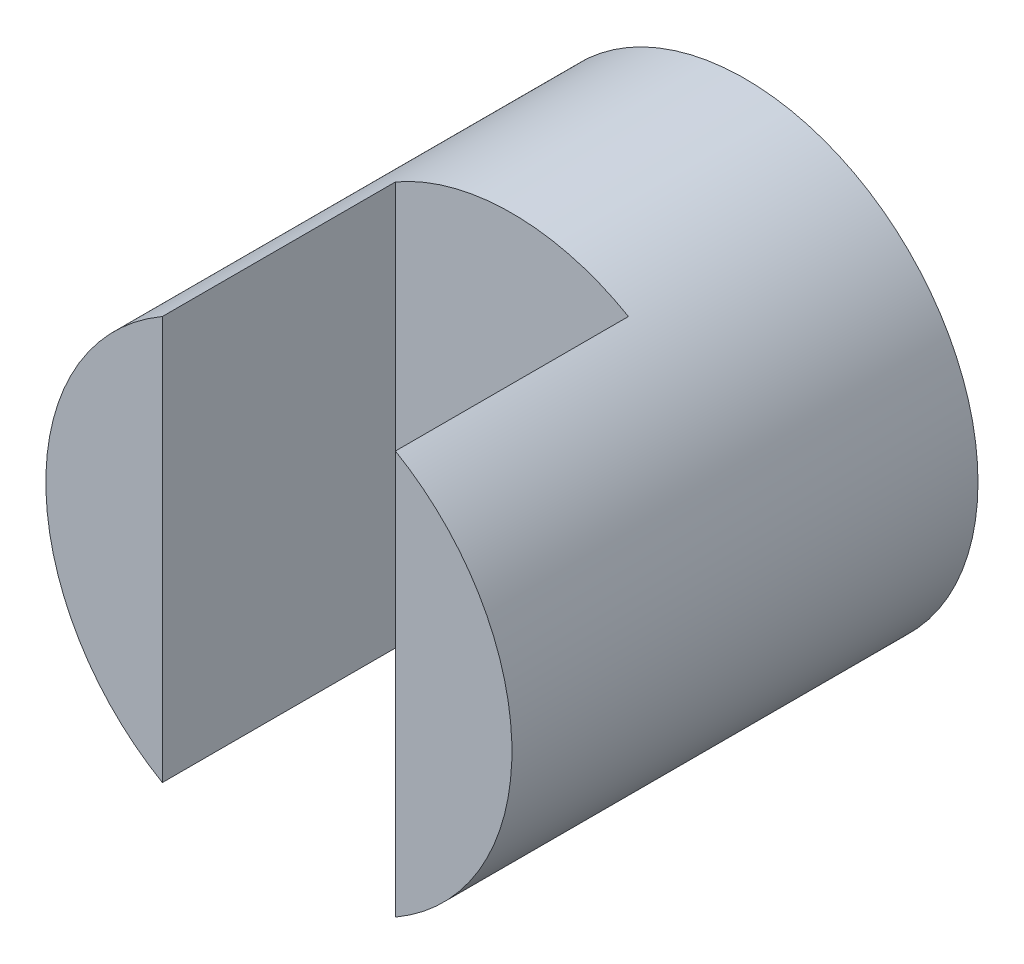
ISO-10303-21;
HEADER;
FILE_DESCRIPTION(('STEP AP214'),'2;1');
FILE_NAME('part.step','',(''),(''),'','','');
FILE_SCHEMA(('AUTOMOTIVE_DESIGN { 1 0 10303 214 1 1 1 1 }'));
ENDSEC;
DATA;
#1=APPLICATION_CONTEXT('core data for automotive mechanical design processes');
#2=APPLICATION_PROTOCOL_DEFINITION('international standard','automotive_design',2000,#1);
#3=PRODUCT_CONTEXT('',#1,'mechanical');
#4=PRODUCT('Part','Part','',(#3));
#5=PRODUCT_RELATED_PRODUCT_CATEGORY('part','',(#4));
#6=PRODUCT_DEFINITION_FORMATION('','',#4);
#7=PRODUCT_DEFINITION_CONTEXT('part definition',#1,'design');
#8=PRODUCT_DEFINITION('design','',#6,#7);
#9=PRODUCT_DEFINITION_SHAPE('','',#8);
#10=(LENGTH_UNIT() NAMED_UNIT(*) SI_UNIT(.MILLI.,.METRE.));
#11=(NAMED_UNIT(*) PLANE_ANGLE_UNIT() SI_UNIT($,.RADIAN.));
#12=(NAMED_UNIT(*) SI_UNIT($,.STERADIAN.) SOLID_ANGLE_UNIT());
#13=UNCERTAINTY_MEASURE_WITH_UNIT(LENGTH_MEASURE(1.E-05),#10,'distance_accuracy_value','');
#14=(GEOMETRIC_REPRESENTATION_CONTEXT(3) GLOBAL_UNCERTAINTY_ASSIGNED_CONTEXT((#13)) GLOBAL_UNIT_ASSIGNED_CONTEXT((#10,
#11,#12)) REPRESENTATION_CONTEXT('',''));
#15=CARTESIAN_POINT('',(0.,0.,0.));
#16=DIRECTION('',(0.,0.,1.));
#17=DIRECTION('',(1.,0.,0.));
#18=AXIS2_PLACEMENT_3D('',#15,#16,#17);
#19=CARTESIAN_POINT('',(0.,0.,4.));
#20=DIRECTION('',(0.,0.,1.));
#21=DIRECTION('',(1.,0.,0.));
#22=AXIS2_PLACEMENT_3D('',#19,#20,#21);
#23=PLANE('',#22);
#24=DIRECTION('',(0.,1.,0.));
#25=VECTOR('',#24,1.);
#26=CARTESIAN_POINT('',(1.,0.,4.));
#27=LINE('',#26,#25);
#28=CARTESIAN_POINT('',(1.,-1.73205080756888,4.));
#29=VERTEX_POINT('',#28);
#30=CARTESIAN_POINT('',(1.,1.73205080756888,4.));
#31=VERTEX_POINT('',#30);
#32=EDGE_CURVE('E56',#29,#31,#27,.T.);
#33=ORIENTED_EDGE('',*,*,#32,.F.);
#34=CARTESIAN_POINT('',(0.,0.,4.));
#35=DIRECTION('',(0.,0.,1.));
#36=DIRECTION('',(1.,0.,0.));
#37=AXIS2_PLACEMENT_3D('',#34,#35,#36);
#38=CIRCLE('',#37,2.);
#39=EDGE_CURVE('E94',#29,#31,#38,.T.);
#40=ORIENTED_EDGE('',*,*,#39,.T.);
#41=EDGE_LOOP('',(#33,#40));
#42=FACE_BOUND('',#41,.T.);
#43=ADVANCED_FACE('F33',(#42),#23,.T.);
#44=CARTESIAN_POINT('',(0.,0.,4.));
#45=DIRECTION('',(0.,0.,-1.));
#46=DIRECTION('',(-1.,0.,0.));
#47=AXIS2_PLACEMENT_3D('',#44,#45,#46);
#48=CYLINDRICAL_SURFACE('',#47,2.);
#49=CARTESIAN_POINT('',(-1.,1.73205080756888,4.));
#50=VERTEX_POINT('',#49);
#51=CARTESIAN_POINT('',(-1.,-1.73205080756888,4.));
#52=VERTEX_POINT('',#51);
#53=EDGE_CURVE('E103',#50,#52,#38,.T.);
#54=ORIENTED_EDGE('',*,*,#53,.F.);
#55=DIRECTION('',(0.,0.,-1.));
#56=VECTOR('',#55,1.);
#57=CARTESIAN_POINT('',(-1.,1.73205080756888,4.));
#58=LINE('',#57,#56);
#59=CARTESIAN_POINT('',(-1.,1.73205080756888,2.));
#60=VERTEX_POINT('',#59);
#61=EDGE_CURVE('E48',#50,#60,#58,.T.);
#62=ORIENTED_EDGE('',*,*,#61,.T.);
#63=CARTESIAN_POINT('',(0.,0.,2.));
#64=DIRECTION('',(0.,0.,-1.));
#65=DIRECTION('',(-1.,0.,0.));
#66=AXIS2_PLACEMENT_3D('',#63,#64,#65);
#67=CIRCLE('',#66,2.);
#68=CARTESIAN_POINT('',(1.,1.73205080756888,2.));
#69=VERTEX_POINT('',#68);
#70=EDGE_CURVE('E37',#60,#69,#67,.T.);
#71=ORIENTED_EDGE('',*,*,#70,.T.);
#72=DIRECTION('',(0.,0.,-1.));
#73=VECTOR('',#72,1.);
#74=CARTESIAN_POINT('',(1.,1.73205080756888,4.));
#75=LINE('',#74,#73);
#76=EDGE_CURVE('E96',#69,#31,#75,.F.);
#77=ORIENTED_EDGE('',*,*,#76,.T.);
#78=ORIENTED_EDGE('',*,*,#39,.F.);
#79=DIRECTION('',(0.,0.,-1.));
#80=VECTOR('',#79,1.);
#81=CARTESIAN_POINT('',(1.,-1.73205080756888,4.));
#82=LINE('',#81,#80);
#83=CARTESIAN_POINT('',(1.,-1.73205080756888,2.));
#84=VERTEX_POINT('',#83);
#85=EDGE_CURVE('E92',#29,#84,#82,.T.);
#86=ORIENTED_EDGE('',*,*,#85,.T.);
#87=CARTESIAN_POINT('',(-1.,-1.73205080756888,2.));
#88=VERTEX_POINT('',#87);
#89=EDGE_CURVE('E11',#84,#88,#67,.T.);
#90=ORIENTED_EDGE('',*,*,#89,.T.);
#91=DIRECTION('',(0.,0.,-1.));
#92=VECTOR('',#91,1.);
#93=CARTESIAN_POINT('',(-1.,-1.73205080756888,4.));
#94=LINE('',#93,#92);
#95=EDGE_CURVE('E73',#88,#52,#94,.F.);
#96=ORIENTED_EDGE('',*,*,#95,.T.);
#97=EDGE_LOOP('',(#54,#62,#71,#77,#78,#86,#90,#96));
#98=FACE_BOUND('',#97,.T.);
#99=CARTESIAN_POINT('',(0.,0.,0.));
#100=DIRECTION('',(0.,0.,1.));
#101=DIRECTION('',(1.,0.,0.));
#102=AXIS2_PLACEMENT_3D('',#99,#100,#101);
#103=CIRCLE('',#102,2.);
#104=CARTESIAN_POINT('',(2.,0.,0.));
#105=VERTEX_POINT('',#104);
#106=EDGE_CURVE('E95',#105,#105,#103,.T.);
#107=ORIENTED_EDGE('',*,*,#106,.T.);
#108=EDGE_LOOP('',(#107));
#109=FACE_BOUND('',#108,.T.);
#110=ADVANCED_FACE('F35',(#98,#109),#48,.T.);
#111=DIRECTION('',(0.,-1.,0.));
#112=VECTOR('',#111,1.);
#113=CARTESIAN_POINT('',(-1.,0.,4.));
#114=LINE('',#113,#112);
#115=EDGE_CURVE('E77',#50,#52,#114,.T.);
#116=ORIENTED_EDGE('',*,*,#115,.F.);
#117=ORIENTED_EDGE('',*,*,#53,.T.);
#118=EDGE_LOOP('',(#116,#117));
#119=FACE_BOUND('',#118,.T.);
#120=ADVANCED_FACE('F119',(#119),#23,.T.);
#121=CARTESIAN_POINT('',(0.,0.,0.));
#122=DIRECTION('',(0.,0.,1.));
#123=DIRECTION('',(1.,0.,0.));
#124=AXIS2_PLACEMENT_3D('',#121,#122,#123);
#125=PLANE('',#124);
#126=ORIENTED_EDGE('',*,*,#106,.F.);
#127=EDGE_LOOP('',(#126));
#128=FACE_BOUND('',#127,.T.);
#129=ADVANCED_FACE('F114',(#128),#125,.F.);
#130=CARTESIAN_POINT('',(-1.,-2.,2.));
#131=DIRECTION('',(0.,0.,-1.));
#132=DIRECTION('',(-1.,0.,0.));
#133=AXIS2_PLACEMENT_3D('',#130,#131,#132);
#134=PLANE('',#133);
#135=DIRECTION('',(0.,1.,0.));
#136=VECTOR('',#135,1.);
#137=CARTESIAN_POINT('',(-1.,-2.,2.));
#138=LINE('',#137,#136);
#139=EDGE_CURVE('E76',#88,#60,#138,.T.);
#140=ORIENTED_EDGE('',*,*,#139,.F.);
#141=ORIENTED_EDGE('',*,*,#89,.F.);
#142=DIRECTION('',(0.,1.,0.));
#143=VECTOR('',#142,1.);
#144=CARTESIAN_POINT('',(1.,-2.,2.));
#145=LINE('',#144,#143);
#146=EDGE_CURVE('E87',#84,#69,#145,.T.);
#147=ORIENTED_EDGE('',*,*,#146,.T.);
#148=ORIENTED_EDGE('',*,*,#70,.F.);
#149=EDGE_LOOP('',(#140,#141,#147,#148));
#150=FACE_BOUND('',#149,.T.);
#151=ADVANCED_FACE('F83',(#150),#134,.F.);
#152=CARTESIAN_POINT('',(1.,-2.,6.));
#153=DIRECTION('',(1.,0.,0.));
#154=DIRECTION('',(0.,0.,-1.));
#155=AXIS2_PLACEMENT_3D('',#152,#153,#154);
#156=PLANE('',#155);
#157=ORIENTED_EDGE('',*,*,#32,.T.);
#158=ORIENTED_EDGE('',*,*,#76,.F.);
#159=ORIENTED_EDGE('',*,*,#146,.F.);
#160=ORIENTED_EDGE('',*,*,#85,.F.);
#161=EDGE_LOOP('',(#157,#158,#159,#160));
#162=FACE_BOUND('',#161,.T.);
#163=ADVANCED_FACE('F106',(#162),#156,.F.);
#164=CARTESIAN_POINT('',(-1.,-2.,6.));
#165=DIRECTION('',(-1.,0.,0.));
#166=DIRECTION('',(0.,0.,1.));
#167=AXIS2_PLACEMENT_3D('',#164,#165,#166);
#168=PLANE('',#167);
#169=ORIENTED_EDGE('',*,*,#115,.T.);
#170=ORIENTED_EDGE('',*,*,#95,.F.);
#171=ORIENTED_EDGE('',*,*,#139,.T.);
#172=ORIENTED_EDGE('',*,*,#61,.F.);
#173=EDGE_LOOP('',(#169,#170,#171,#172));
#174=FACE_BOUND('',#173,.T.);
#175=ADVANCED_FACE('F75',(#174),#168,.F.);
#176=CLOSED_SHELL('',(#43,#110,#120,#129,#151,#163,#175));
#177=MANIFOLD_SOLID_BREP('B2',#176);
#178=ADVANCED_BREP_SHAPE_REPRESENTATION('',(#18,#177),#14);
#179=SHAPE_DEFINITION_REPRESENTATION(#9,#178);
ENDSEC;
END-ISO-10303-21;
